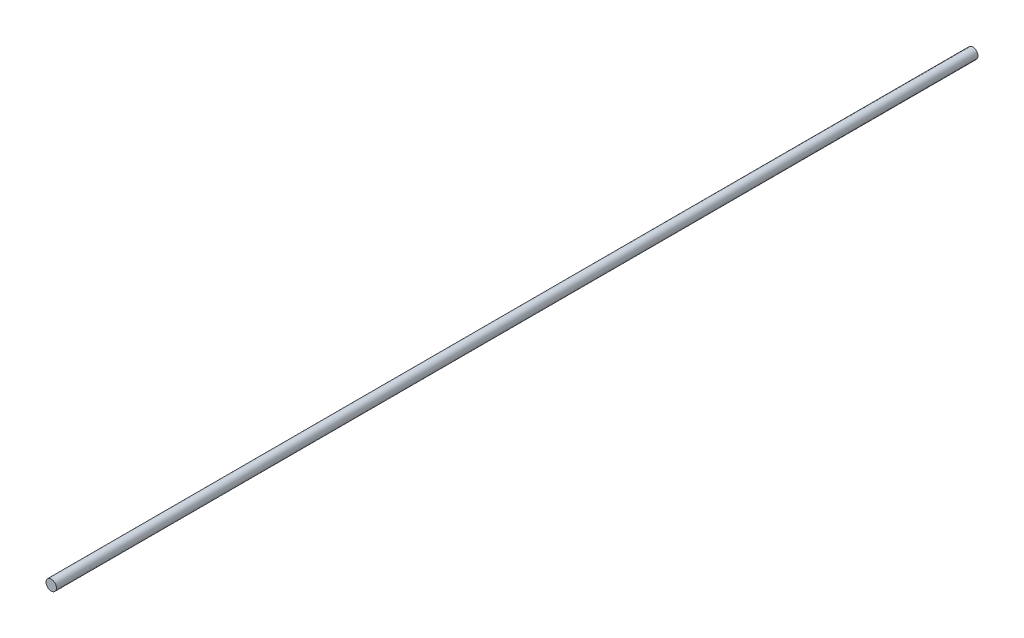
ISO-10303-21;
HEADER;
FILE_DESCRIPTION(('STEP AP214'),'2;1');
FILE_NAME('part.step','',(''),(''),'','','');
FILE_SCHEMA(('AUTOMOTIVE_DESIGN { 1 0 10303 214 1 1 1 1 }'));
ENDSEC;
DATA;
#1=APPLICATION_CONTEXT('core data for automotive mechanical design processes');
#2=APPLICATION_PROTOCOL_DEFINITION('international standard','automotive_design',2000,#1);
#3=PRODUCT_CONTEXT('',#1,'mechanical');
#4=PRODUCT('Part','Part','',(#3));
#5=PRODUCT_RELATED_PRODUCT_CATEGORY('part','',(#4));
#6=PRODUCT_DEFINITION_FORMATION('','',#4);
#7=PRODUCT_DEFINITION_CONTEXT('part definition',#1,'design');
#8=PRODUCT_DEFINITION('design','',#6,#7);
#9=PRODUCT_DEFINITION_SHAPE('','',#8);
#10=(LENGTH_UNIT() NAMED_UNIT(*) SI_UNIT(.MILLI.,.METRE.));
#11=(NAMED_UNIT(*) PLANE_ANGLE_UNIT() SI_UNIT($,.RADIAN.));
#12=(NAMED_UNIT(*) SI_UNIT($,.STERADIAN.) SOLID_ANGLE_UNIT());
#13=UNCERTAINTY_MEASURE_WITH_UNIT(LENGTH_MEASURE(1.E-05),#10,'distance_accuracy_value','');
#14=(GEOMETRIC_REPRESENTATION_CONTEXT(3) GLOBAL_UNCERTAINTY_ASSIGNED_CONTEXT((#13)) GLOBAL_UNIT_ASSIGNED_CONTEXT((#10,
#11,#12)) REPRESENTATION_CONTEXT('',''));
#15=CARTESIAN_POINT('',(0.,0.,0.));
#16=DIRECTION('',(0.,0.,1.));
#17=DIRECTION('',(1.,0.,0.));
#18=AXIS2_PLACEMENT_3D('',#15,#16,#17);
#19=CARTESIAN_POINT('',(0.,0.,2300.));
#20=DIRECTION('',(0.,0.,-1.));
#21=DIRECTION('',(-1.,0.,0.));
#22=AXIS2_PLACEMENT_3D('',#19,#20,#21);
#23=CYLINDRICAL_SURFACE('',#22,13.0000000000001);
#24=CARTESIAN_POINT('',(0.,0.,2300.));
#25=DIRECTION('',(0.,0.,-1.));
#26=DIRECTION('',(-1.,0.,0.));
#27=AXIS2_PLACEMENT_3D('',#24,#25,#26);
#28=CIRCLE('',#27,13.0000000000003);
#29=CARTESIAN_POINT('',(-13.0000000000003,0.,2300.));
#30=VERTEX_POINT('',#29);
#31=EDGE_CURVE('E10',#30,#30,#28,.T.);
#32=ORIENTED_EDGE('',*,*,#31,.T.);
#33=EDGE_LOOP('',(#32));
#34=FACE_BOUND('',#33,.T.);
#35=CARTESIAN_POINT('',(0.,0.,0.));
#36=DIRECTION('',(0.,0.,-1.));
#37=DIRECTION('',(-1.,0.,0.));
#38=AXIS2_PLACEMENT_3D('',#35,#36,#37);
#39=CIRCLE('',#38,13.);
#40=CARTESIAN_POINT('',(-13.,0.,0.));
#41=VERTEX_POINT('',#40);
#42=EDGE_CURVE('E37',#41,#41,#39,.T.);
#43=ORIENTED_EDGE('',*,*,#42,.F.);
#44=EDGE_LOOP('',(#43));
#45=FACE_BOUND('',#44,.T.);
#46=ADVANCED_FACE('F31',(#34,#45),#23,.T.);
#47=CARTESIAN_POINT('',(13.0000000000002,0.,2300.));
#48=DIRECTION('',(0.,0.,1.));
#49=DIRECTION('',(1.,0.,0.));
#50=AXIS2_PLACEMENT_3D('',#47,#48,#49);
#51=PLANE('',#50);
#52=ORIENTED_EDGE('',*,*,#31,.F.);
#53=EDGE_LOOP('',(#52));
#54=FACE_BOUND('',#53,.T.);
#55=ADVANCED_FACE('F46',(#54),#51,.T.);
#56=CARTESIAN_POINT('',(0.,0.,0.));
#57=DIRECTION('',(0.,0.,-1.));
#58=DIRECTION('',(-1.,0.,0.));
#59=AXIS2_PLACEMENT_3D('',#56,#57,#58);
#60=PLANE('',#59);
#61=ORIENTED_EDGE('',*,*,#42,.T.);
#62=EDGE_LOOP('',(#61));
#63=FACE_BOUND('',#62,.T.);
#64=ADVANCED_FACE('F43',(#63),#60,.T.);
#65=CLOSED_SHELL('',(#46,#55,#64));
#66=MANIFOLD_SOLID_BREP('B2',#65);
#67=ADVANCED_BREP_SHAPE_REPRESENTATION('',(#18,#66),#14);
#68=SHAPE_DEFINITION_REPRESENTATION(#9,#67);
ENDSEC;
END-ISO-10303-21;
